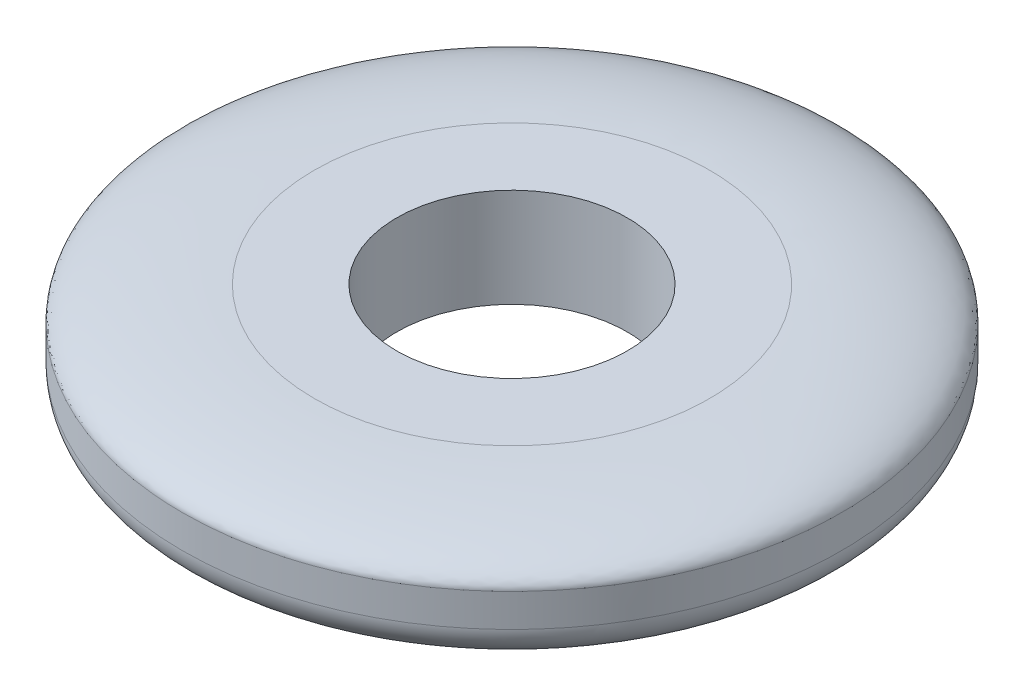
ISO-10303-21;
HEADER;
FILE_DESCRIPTION(('STEP AP214'),'2;1');
FILE_NAME('part.step','',(''),(''),'','','');
FILE_SCHEMA(('AUTOMOTIVE_DESIGN { 1 0 10303 214 1 1 1 1 }'));
ENDSEC;
DATA;
#1=APPLICATION_CONTEXT('core data for automotive mechanical design processes');
#2=APPLICATION_PROTOCOL_DEFINITION('international standard','automotive_design',2000,#1);
#3=PRODUCT_CONTEXT('',#1,'mechanical');
#4=PRODUCT('Part','Part','',(#3));
#5=PRODUCT_RELATED_PRODUCT_CATEGORY('part','',(#4));
#6=PRODUCT_DEFINITION_FORMATION('','',#4);
#7=PRODUCT_DEFINITION_CONTEXT('part definition',#1,'design');
#8=PRODUCT_DEFINITION('design','',#6,#7);
#9=PRODUCT_DEFINITION_SHAPE('','',#8);
#10=(LENGTH_UNIT() NAMED_UNIT(*) SI_UNIT(.MILLI.,.METRE.));
#11=(NAMED_UNIT(*) PLANE_ANGLE_UNIT() SI_UNIT($,.RADIAN.));
#12=(NAMED_UNIT(*) SI_UNIT($,.STERADIAN.) SOLID_ANGLE_UNIT());
#13=UNCERTAINTY_MEASURE_WITH_UNIT(LENGTH_MEASURE(1.E-05),#10,'distance_accuracy_value','');
#14=(GEOMETRIC_REPRESENTATION_CONTEXT(3) GLOBAL_UNCERTAINTY_ASSIGNED_CONTEXT((#13)) GLOBAL_UNIT_ASSIGNED_CONTEXT((#10,
#11,#12)) REPRESENTATION_CONTEXT('',''));
#15=CARTESIAN_POINT('',(0.,0.,0.));
#16=DIRECTION('',(0.,0.,1.));
#17=DIRECTION('',(1.,0.,0.));
#18=AXIS2_PLACEMENT_3D('',#15,#16,#17);
#19=CARTESIAN_POINT('',(0.,3.,0.));
#20=DIRECTION('',(0.,1.,0.));
#21=DIRECTION('',(0.,0.,1.));
#22=AXIS2_PLACEMENT_3D('',#19,#20,#21);
#23=PLANE('',#22);
#24=CARTESIAN_POINT('',(0.,3.,6.));
#25=CARTESIAN_POINT('',(-0.392699079881202,3.,6.));
#26=CARTESIAN_POINT('',(-0.785388454921949,3.,5.96132347236873));
#27=CARTESIAN_POINT('',(-1.55569540927161,3.,5.80809989247003));
#28=CARTESIAN_POINT('',(-1.93329395185282,3.,5.6935566268431));
#29=CARTESIAN_POINT('',(-2.65890723652827,3.,5.39299776329234));
#30=CARTESIAN_POINT('',(-3.00690404641762,3.,5.20698959313112));
#31=CARTESIAN_POINT('',(-3.65993874981762,3.,4.77064575449942));
#32=CARTESIAN_POINT('',(-3.96496050476997,3.,4.5203208694686));
#33=CARTESIAN_POINT('',(-4.52032086946862,3.,3.96496050476995));
#34=CARTESIAN_POINT('',(-4.77064575449942,3.,3.6599387498177));
#35=CARTESIAN_POINT('',(-5.20698959313112,3.,3.00690404641752));
#36=CARTESIAN_POINT('',(-5.39299776329234,3.,2.65890723652834));
#37=CARTESIAN_POINT('',(-5.69355662684311,3.,1.93329395185272));
#38=CARTESIAN_POINT('',(-5.80809989247021,3.,1.55569540927164));
#39=CARTESIAN_POINT('',(-5.96132347236856,3.,0.785388454921894));
#40=CARTESIAN_POINT('',(-6.,3.,0.392699079880683));
#41=CARTESIAN_POINT('',(-6.,3.,-0.392699079880664));
#42=CARTESIAN_POINT('',(-5.96132347236873,3.,-0.785388454921949));
#43=CARTESIAN_POINT('',(-5.80809989247003,3.,-1.55569540927161));
#44=CARTESIAN_POINT('',(-5.6935566268431,3.,-1.93329395185274));
#45=CARTESIAN_POINT('',(-5.39299776329234,3.,-2.65890723652835));
#46=CARTESIAN_POINT('',(-5.20698959313112,3.,-3.00690404641779));
#47=CARTESIAN_POINT('',(-4.77064575449942,3.,-3.65993874981745));
#48=CARTESIAN_POINT('',(-4.52032086946862,3.,-3.96496050476979));
#49=CARTESIAN_POINT('',(-3.96496050476996,3.,-4.52032086946878));
#50=CARTESIAN_POINT('',(-3.65993874981761,3.,-4.77064575449925));
#51=CARTESIAN_POINT('',(-3.00690404641761,3.,-5.2069895931313));
#52=CARTESIAN_POINT('',(-2.65890723652825,3.,-5.39299776329234));
#53=CARTESIAN_POINT('',(-1.93329395185281,3.,-5.69355662684311));
#54=CARTESIAN_POINT('',(-1.55569540927159,3.,-5.80809989247004));
#55=CARTESIAN_POINT('',(-0.785388454921937,3.,-5.96132347236873));
#56=CARTESIAN_POINT('',(-0.392699079880673,3.,-6.));
#57=CARTESIAN_POINT('',(0.392699079880674,3.,-6.));
#58=CARTESIAN_POINT('',(0.785388454921903,3.,-5.96132347236873));
#59=CARTESIAN_POINT('',(1.55569540927164,3.,-5.80809989247004));
#60=CARTESIAN_POINT('',(1.93329395185274,3.,-5.6935566268431));
#61=CARTESIAN_POINT('',(2.65890723652835,3.,-5.39299776329233));
#62=CARTESIAN_POINT('',(3.00690404641761,3.,-5.20698959313112));
#63=CARTESIAN_POINT('',(3.65993874981762,3.,-4.77064575449942));
#64=CARTESIAN_POINT('',(3.96496050476996,3.,-4.52032086946862));
#65=CARTESIAN_POINT('',(4.52032086946861,3.,-3.96496050476996));
#66=CARTESIAN_POINT('',(4.77064575449925,3.,-3.65993874981753));
#67=CARTESIAN_POINT('',(5.2069895931313,3.,-3.00690404641769));
#68=CARTESIAN_POINT('',(5.39299776329231,3.,-2.65890723652832));
#69=CARTESIAN_POINT('',(5.69355662684313,3.,-1.93329395185276));
#70=CARTESIAN_POINT('',(5.8080998924701,3.,-1.55569540927164));
#71=CARTESIAN_POINT('',(5.96132347236866,3.,-0.785388454921893));
#72=CARTESIAN_POINT('',(6.,3.,-0.392699079880672));
#73=CARTESIAN_POINT('',(6.,3.,0.392699079880673));
#74=CARTESIAN_POINT('',(5.96132347236866,3.,0.785388454921901));
#75=CARTESIAN_POINT('',(5.8080998924701,3.,1.55569540927165));
#76=CARTESIAN_POINT('',(5.69355662684313,3.,1.93329395185284));
#77=CARTESIAN_POINT('',(5.39299776329231,3.,2.65890723652823));
#78=CARTESIAN_POINT('',(5.20698959313124,3.,3.0069040464176));
#79=CARTESIAN_POINT('',(4.7706457544993,3.,3.65993874981762));
#80=CARTESIAN_POINT('',(4.52032086946864,3.,3.9649605047701));
#81=CARTESIAN_POINT('',(3.96496050476993,3.,4.52032086946847));
#82=CARTESIAN_POINT('',(3.65993874981754,3.,4.7706457544993));
#83=CARTESIAN_POINT('',(3.00690404641769,3.,5.20698959313124));
#84=CARTESIAN_POINT('',(2.65890723652832,3.,5.39299776329248));
#85=CARTESIAN_POINT('',(1.93329395185276,3.,5.69355662684296));
#86=CARTESIAN_POINT('',(1.55569540927162,3.,5.80809989246978));
#87=CARTESIAN_POINT('',(0.785388454921918,3.,5.96132347236899));
#88=CARTESIAN_POINT('',(0.392699079881201,3.,6.));
#89=CARTESIAN_POINT('',(0.,3.,6.));
#90=(BOUNDED_CURVE() B_SPLINE_CURVE(3,(#24,#25,#26,#27,#28,#29,#30,#31,#32,#33,#34,#35,#36,#37,
#38,#39,#40,#41,#42,#43,#44,#45,#46,#47,#48,#49,#50,#51,#52,#53,#54,#55,#56,#57,#58,#59,#60,#61,
#62,#63,#64,#65,#66,#67,#68,#69,#70,#71,#72,#73,#74,#75,#76,#77,#78,#79,#80,#81,#82,#83,#84,#85,
#86,#87,#88,#89),.UNSPECIFIED.,.T.,.F.) B_SPLINE_CURVE_WITH_KNOTS((4,2,2,2,2,2,2,2,2,2,2,2,2,2,
2,2,2,2,2,2,2,2,2,2,2,2,2,2,2,2,2,2,4),(0.,0.196349540849362,0.392699081698725,
0.589048622548086,0.785398163397448,0.981747704246811,1.17809724509617,1.37444678594553,
1.5707963267949,1.76714586764426,1.96349540849362,2.15984494934298,2.35619449019234,
2.55254403104171,2.74889357189107,2.94524311274043,3.14159265358979,3.33794219443916,
3.53429173528852,3.73064127613788,3.92699081698724,4.1233403578366,4.31968989868597,
4.51603943953533,4.71238898038469,4.90873852123405,5.10508806208341,5.30143760293278,
5.49778714378214,5.6941366846315,5.89048622548086,6.08683576633022,6.28318530717959),
.UNSPECIFIED.) CURVE() GEOMETRIC_REPRESENTATION_ITEM() RATIONAL_B_SPLINE_CURVE((1.,1.,1.,1.,1.,
1.,1.,1.,1.,1.,1.,1.,1.,1.,1.,1.,1.,1.,1.,1.,1.,1.,1.,1.,1.,1.,1.,1.,1.,1.,1.,1.,1.,1.,1.,1.,1.,
1.,1.,1.,1.,1.,1.,1.,1.,1.,1.,1.,1.,1.,1.,1.,1.,1.,1.,1.,1.,1.,1.,1.,1.,1.,1.,1.,1.,1.)) REPRESENTATION_ITEM(''));
#91=CARTESIAN_POINT('',(0.,3.,6.));
#92=VERTEX_POINT('',#91);
#93=EDGE_CURVE('E54',#92,#92,#90,.F.);
#94=ORIENTED_EDGE('',*,*,#93,.T.);
#95=EDGE_LOOP('',(#94));
#96=FACE_BOUND('',#95,.T.);
#97=CARTESIAN_POINT('',(0.,3.,0.));
#98=DIRECTION('',(0.,1.,0.));
#99=DIRECTION('',(0.,0.,1.));
#100=AXIS2_PLACEMENT_3D('',#97,#98,#99);
#101=CIRCLE('',#100,3.5);
#102=CARTESIAN_POINT('',(0.,3.,3.5));
#103=VERTEX_POINT('',#102);
#104=EDGE_CURVE('E148',#103,#103,#101,.T.);
#105=ORIENTED_EDGE('',*,*,#104,.F.);
#106=EDGE_LOOP('',(#105));
#107=FACE_BOUND('',#106,.T.);
#108=ADVANCED_FACE('F40',(#96,#107),#23,.T.);
#109=CARTESIAN_POINT('',(0.,0.,0.));
#110=DIRECTION('',(0.,1.,0.));
#111=DIRECTION('',(0.,0.,1.));
#112=AXIS2_PLACEMENT_3D('',#109,#110,#111);
#113=PLANE('',#112);
#114=CARTESIAN_POINT('',(0.,0.,0.));
#115=DIRECTION('',(0.,1.,0.));
#116=DIRECTION('',(0.,0.,1.));
#117=AXIS2_PLACEMENT_3D('',#114,#115,#116);
#118=CIRCLE('',#117,9.);
#119=CARTESIAN_POINT('',(0.,0.,9.));
#120=VERTEX_POINT('',#119);
#121=EDGE_CURVE('E11',#120,#120,#118,.F.);
#122=ORIENTED_EDGE('',*,*,#121,.T.);
#123=EDGE_LOOP('',(#122));
#124=FACE_BOUND('',#123,.T.);
#125=CARTESIAN_POINT('',(0.,0.,0.));
#126=DIRECTION('',(0.,1.,0.));
#127=DIRECTION('',(0.,0.,1.));
#128=AXIS2_PLACEMENT_3D('',#125,#126,#127);
#129=CIRCLE('',#128,3.5);
#130=CARTESIAN_POINT('',(0.,0.,3.5));
#131=VERTEX_POINT('',#130);
#132=EDGE_CURVE('E146',#131,#131,#129,.T.);
#133=ORIENTED_EDGE('',*,*,#132,.T.);
#134=EDGE_LOOP('',(#133));
#135=FACE_BOUND('',#134,.T.);
#136=ADVANCED_FACE('F137',(#124,#135),#113,.F.);
#137=CARTESIAN_POINT('',(0.,3.,0.));
#138=DIRECTION('',(0.,-1.,0.));
#139=DIRECTION('',(0.,0.,-1.));
#140=AXIS2_PLACEMENT_3D('',#137,#138,#139);
#141=CYLINDRICAL_SURFACE('',#140,10.);
#142=CARTESIAN_POINT('',(0.,1.,0.));
#143=DIRECTION('',(0.,1.,0.));
#144=DIRECTION('',(0.,0.,1.));
#145=AXIS2_PLACEMENT_3D('',#142,#143,#144);
#146=CIRCLE('',#145,10.);
#147=CARTESIAN_POINT('',(0.,1.,10.));
#148=VERTEX_POINT('',#147);
#149=EDGE_CURVE('E46',#148,#148,#146,.T.);
#150=ORIENTED_EDGE('',*,*,#149,.T.);
#151=EDGE_LOOP('',(#150));
#152=FACE_BOUND('',#151,.T.);
#153=CARTESIAN_POINT('',(0.,2.,10.));
#154=CARTESIAN_POINT('',(0.654498466468669,2.,10.));
#155=CARTESIAN_POINT('',(1.30898075820319,2.,9.93553912061457));
#156=CARTESIAN_POINT('',(2.59282568211937,2.,9.68016648745004));
#157=CARTESIAN_POINT('',(3.22215658642126,2.,9.48926104473846));
#158=CARTESIAN_POINT('',(4.43151206088053,2.,8.98832960548728));
#159=CARTESIAN_POINT('',(5.01150674402935,2.,8.67831598855199));
#160=CARTESIAN_POINT('',(6.0998979163627,2.,7.95107625749891));
#161=CARTESIAN_POINT('',(6.60826750794994,2.,7.53386811578101));
#162=CARTESIAN_POINT('',(7.53386811578101,2.,6.60826750794994));
#163=CARTESIAN_POINT('',(7.95107625749883,2.,6.09989791636281));
#164=CARTESIAN_POINT('',(8.67831598855208,2.,5.01150674402923));
#165=CARTESIAN_POINT('',(8.98832960548729,2.,4.4315120608805));
#166=CARTESIAN_POINT('',(9.48926104473845,2.,3.22215658642128));
#167=CARTESIAN_POINT('',(9.68016648745003,2.,2.59282568211947));
#168=CARTESIAN_POINT('',(9.93553912061459,2.,1.30898075820311));
#169=CARTESIAN_POINT('',(10.,2.,0.654498466467789));
#170=CARTESIAN_POINT('',(10.,2.,-0.654498466467787));
#171=CARTESIAN_POINT('',(9.93553912061457,2.,-1.30898075820316));
#172=CARTESIAN_POINT('',(9.68016648745004,2.,-2.59282568211939));
#173=CARTESIAN_POINT('',(9.48926104473848,2.,-3.22215658642122));
#174=CARTESIAN_POINT('',(8.98832960548726,2.,-4.43151206088058));
#175=CARTESIAN_POINT('',(8.67831598855193,2.,-5.01150674402944));
#176=CARTESIAN_POINT('',(7.95107625749898,2.,-6.09989791636259));
#177=CARTESIAN_POINT('',(7.53386811578099,2.,-6.60826750794996));
#178=CARTESIAN_POINT('',(6.60826750794995,2.,-7.533868115781));
#179=CARTESIAN_POINT('',(6.09989791636265,2.,-7.95107625749894));
#180=CARTESIAN_POINT('',(5.01150674402941,2.,-8.67831598855195));
#181=CARTESIAN_POINT('',(4.43151206088059,2.,-8.98832960548725));
#182=CARTESIAN_POINT('',(3.22215658642123,2.,-9.48926104473847));
#183=CARTESIAN_POINT('',(2.59282568211943,2.,-9.68016648745003));
#184=CARTESIAN_POINT('',(1.30898075820315,2.,-9.93553912061458));
#185=CARTESIAN_POINT('',(0.65449846646779,2.,-10.));
#186=CARTESIAN_POINT('',(-0.654498466467788,2.,-10.));
#187=CARTESIAN_POINT('',(-1.30898075820321,2.,-9.93553912061456));
#188=CARTESIAN_POINT('',(-2.59282568211934,2.,-9.68016648745005));
#189=CARTESIAN_POINT('',(-3.22215658642135,2.,-9.48926104473842));
#190=CARTESIAN_POINT('',(-4.43151206088042,2.,-8.98832960548733));
#191=CARTESIAN_POINT('',(-5.01150674402932,2.,-8.67831598855201));
#192=CARTESIAN_POINT('',(-6.09989791636271,2.,-7.9510762574989));
#193=CARTESIAN_POINT('',(-6.60826750794988,2.,-7.53386811578107));
#194=CARTESIAN_POINT('',(-7.53386811578108,2.,-6.60826750794987));
#195=CARTESIAN_POINT('',(-7.95107625749913,2.,-6.09989791636237));
#196=CARTESIAN_POINT('',(-8.67831598855177,2.,-5.01150674402969));
#197=CARTESIAN_POINT('',(-8.98832960548725,2.,-4.43151206088059));
#198=CARTESIAN_POINT('',(-9.48926104473847,2.,-3.22215658642123));
#199=CARTESIAN_POINT('',(-9.68016648745006,2.,-2.59282568211929));
#200=CARTESIAN_POINT('',(-9.93553912061455,2.,-1.3089807582033));
#201=CARTESIAN_POINT('',(-10.,2.,-0.654498466467773));
#202=CARTESIAN_POINT('',(-10.,2.,0.654498466467805));
#203=CARTESIAN_POINT('',(-9.93553912061458,2.,1.30898075820313));
#204=CARTESIAN_POINT('',(-9.68016648745003,2.,2.59282568211942));
#205=CARTESIAN_POINT('',(-9.48926104473848,2.,3.2221565864212));
#206=CARTESIAN_POINT('',(-8.98832960548727,2.,4.43151206088056));
#207=CARTESIAN_POINT('',(-8.67831598855211,2.,5.01150674402917));
#208=CARTESIAN_POINT('',(-7.95107625749879,2.,6.09989791636287));
#209=CARTESIAN_POINT('',(-7.53386811578101,2.,6.60826750794994));
#210=CARTESIAN_POINT('',(-6.60826750794998,2.,7.53386811578097));
#211=CARTESIAN_POINT('',(-6.09989791636261,2.,7.95107625749897));
#212=CARTESIAN_POINT('',(-5.01150674402946,2.,8.67831598855192));
#213=CARTESIAN_POINT('',(-4.43151206088044,2.,8.98832960548731));
#214=CARTESIAN_POINT('',(-3.22215658642138,2.,9.48926104473841));
#215=CARTESIAN_POINT('',(-2.59282568211933,2.,9.68016648745005));
#216=CARTESIAN_POINT('',(-1.30898075820326,2.,9.93553912061455));
#217=CARTESIAN_POINT('',(-0.65449846646867,2.,10.));
#218=CARTESIAN_POINT('',(0.,2.,10.));
#219=(BOUNDED_CURVE() B_SPLINE_CURVE(3,(#153,#154,#155,#156,#157,#158,#159,#160,#161,#162,#163,
#164,#165,#166,#167,#168,#169,#170,#171,#172,#173,#174,#175,#176,#177,#178,#179,#180,#181,#182,
#183,#184,#185,#186,#187,#188,#189,#190,#191,#192,#193,#194,#195,#196,#197,#198,#199,#200,#201,
#202,#203,#204,#205,#206,#207,#208,#209,#210,#211,#212,#213,#214,#215,#216,#217,#218),
.UNSPECIFIED.,.T.,.F.) B_SPLINE_CURVE_WITH_KNOTS((4,2,2,2,2,2,2,2,2,2,2,2,2,2,2,2,2,2,2,2,2,2,2,
2,2,2,2,2,2,2,2,2,4),(0.,0.196349540849362,0.392699081698724,0.589048622548086,
0.785398163397448,0.98174770424681,1.17809724509617,1.37444678594553,1.5707963267949,
1.76714586764426,1.96349540849362,2.15984494934298,2.35619449019234,2.55254403104171,
2.74889357189107,2.94524311274043,3.14159265358979,3.33794219443916,3.53429173528852,
3.73064127613788,3.92699081698724,4.1233403578366,4.31968989868597,4.51603943953533,
4.71238898038469,4.90873852123405,5.10508806208341,5.30143760293278,5.49778714378214,
5.6941366846315,5.89048622548086,6.08683576633022,6.28318530717959),
.UNSPECIFIED.) CURVE() GEOMETRIC_REPRESENTATION_ITEM() RATIONAL_B_SPLINE_CURVE((1.,1.,1.,1.,1.,
1.,1.,1.,1.,1.,1.,1.,1.,1.,1.,1.,1.,1.,1.,1.,1.,1.,1.,1.,1.,1.,1.,1.,1.,1.,1.,1.,1.,1.,1.,1.,1.,
1.,1.,1.,1.,1.,1.,1.,1.,1.,1.,1.,1.,1.,1.,1.,1.,1.,1.,1.,1.,1.,1.,1.,1.,1.,1.,1.,1.,1.)) REPRESENTATION_ITEM(''));
#220=CARTESIAN_POINT('',(0.,2.,10.));
#221=VERTEX_POINT('',#220);
#222=EDGE_CURVE('E50',#221,#221,#219,.F.);
#223=ORIENTED_EDGE('',*,*,#222,.T.);
#224=EDGE_LOOP('',(#223));
#225=FACE_BOUND('',#224,.T.);
#226=ADVANCED_FACE('F77',(#152,#225),#141,.T.);
#227=CARTESIAN_POINT('',(0.,3.,0.));
#228=DIRECTION('',(0.,-1.,0.));
#229=DIRECTION('',(0.,0.,-1.));
#230=AXIS2_PLACEMENT_3D('',#227,#228,#229);
#231=CYLINDRICAL_SURFACE('',#230,3.5);
#232=ORIENTED_EDGE('',*,*,#104,.T.);
#233=EDGE_LOOP('',(#232));
#234=FACE_BOUND('',#233,.T.);
#235=ORIENTED_EDGE('',*,*,#132,.F.);
#236=EDGE_LOOP('',(#235));
#237=FACE_BOUND('',#236,.T.);
#238=ADVANCED_FACE('F75',(#234,#237),#231,.F.);
#239=CARTESIAN_POINT('',(0.,3.,6.));
#240=CARTESIAN_POINT('',(0.392699079881201,3.,6.));
#241=CARTESIAN_POINT('',(0.785388454921918,3.,5.96132347236899));
#242=CARTESIAN_POINT('',(1.55569540927162,3.,5.80809989246978));
#243=CARTESIAN_POINT('',(1.93329395185276,3.,5.69355662684296));
#244=CARTESIAN_POINT('',(2.65890723652832,3.,5.39299776329248));
#245=CARTESIAN_POINT('',(3.00690404641769,3.,5.20698959313124));
#246=CARTESIAN_POINT('',(3.65993874981754,3.,4.7706457544993));
#247=CARTESIAN_POINT('',(3.96496050476993,3.,4.52032086946847));
#248=CARTESIAN_POINT('',(4.52032086946864,3.,3.9649605047701));
#249=CARTESIAN_POINT('',(4.7706457544993,3.,3.65993874981762));
#250=CARTESIAN_POINT('',(5.20698959313124,3.,3.0069040464176));
#251=CARTESIAN_POINT('',(5.39299776329231,3.,2.65890723652823));
#252=CARTESIAN_POINT('',(5.69355662684313,3.,1.93329395185284));
#253=CARTESIAN_POINT('',(5.8080998924701,3.,1.55569540927165));
#254=CARTESIAN_POINT('',(5.96132347236866,3.,0.785388454921901));
#255=CARTESIAN_POINT('',(6.,3.,0.392699079880673));
#256=CARTESIAN_POINT('',(6.,3.,-0.392699079880672));
#257=CARTESIAN_POINT('',(5.96132347236866,3.,-0.785388454921893));
#258=CARTESIAN_POINT('',(5.8080998924701,3.,-1.55569540927164));
#259=CARTESIAN_POINT('',(5.69355662684313,3.,-1.93329395185276));
#260=CARTESIAN_POINT('',(5.39299776329231,3.,-2.65890723652832));
#261=CARTESIAN_POINT('',(5.2069895931313,3.,-3.00690404641769));
#262=CARTESIAN_POINT('',(4.77064575449925,3.,-3.65993874981753));
#263=CARTESIAN_POINT('',(4.52032086946861,3.,-3.96496050476996));
#264=CARTESIAN_POINT('',(3.96496050476996,3.,-4.52032086946862));
#265=CARTESIAN_POINT('',(3.65993874981762,3.,-4.77064575449942));
#266=CARTESIAN_POINT('',(3.00690404641761,3.,-5.20698959313112));
#267=CARTESIAN_POINT('',(2.65890723652835,3.,-5.39299776329233));
#268=CARTESIAN_POINT('',(1.93329395185274,3.,-5.6935566268431));
#269=CARTESIAN_POINT('',(1.55569540927164,3.,-5.80809989247004));
#270=CARTESIAN_POINT('',(0.785388454921903,3.,-5.96132347236873));
#271=CARTESIAN_POINT('',(0.392699079880674,3.,-6.));
#272=CARTESIAN_POINT('',(-0.392699079880673,3.,-6.));
#273=CARTESIAN_POINT('',(-0.785388454921937,3.,-5.96132347236873));
#274=CARTESIAN_POINT('',(-1.55569540927159,3.,-5.80809989247004));
#275=CARTESIAN_POINT('',(-1.93329395185281,3.,-5.69355662684311));
#276=CARTESIAN_POINT('',(-2.65890723652825,3.,-5.39299776329234));
#277=CARTESIAN_POINT('',(-3.00690404641761,3.,-5.2069895931313));
#278=CARTESIAN_POINT('',(-3.65993874981761,3.,-4.77064575449925));
#279=CARTESIAN_POINT('',(-3.96496050476996,3.,-4.52032086946878));
#280=CARTESIAN_POINT('',(-4.52032086946862,3.,-3.96496050476979));
#281=CARTESIAN_POINT('',(-4.77064575449942,3.,-3.65993874981745));
#282=CARTESIAN_POINT('',(-5.20698959313112,3.,-3.00690404641779));
#283=CARTESIAN_POINT('',(-5.39299776329234,3.,-2.65890723652835));
#284=CARTESIAN_POINT('',(-5.6935566268431,3.,-1.93329395185274));
#285=CARTESIAN_POINT('',(-5.80809989247003,3.,-1.55569540927161));
#286=CARTESIAN_POINT('',(-5.96132347236873,3.,-0.785388454921949));
#287=CARTESIAN_POINT('',(-6.,3.,-0.392699079880664));
#288=CARTESIAN_POINT('',(-6.,3.,0.392699079880683));
#289=CARTESIAN_POINT('',(-5.96132347236856,3.,0.785388454921894));
#290=CARTESIAN_POINT('',(-5.80809989247021,3.,1.55569540927164));
#291=CARTESIAN_POINT('',(-5.69355662684311,3.,1.93329395185272));
#292=CARTESIAN_POINT('',(-5.39299776329234,3.,2.65890723652834));
#293=CARTESIAN_POINT('',(-5.20698959313112,3.,3.00690404641752));
#294=CARTESIAN_POINT('',(-4.77064575449942,3.,3.6599387498177));
#295=CARTESIAN_POINT('',(-4.52032086946862,3.,3.96496050476995));
#296=CARTESIAN_POINT('',(-3.96496050476997,3.,4.5203208694686));
#297=CARTESIAN_POINT('',(-3.65993874981762,3.,4.77064575449942));
#298=CARTESIAN_POINT('',(-3.00690404641762,3.,5.20698959313112));
#299=CARTESIAN_POINT('',(-2.65890723652827,3.,5.39299776329234));
#300=CARTESIAN_POINT('',(-1.93329395185282,3.,5.6935566268431));
#301=CARTESIAN_POINT('',(-1.55569540927161,3.,5.80809989247003));
#302=CARTESIAN_POINT('',(-0.785388454921949,3.,5.96132347236873));
#303=CARTESIAN_POINT('',(-0.392699079881202,3.,6.));
#304=CARTESIAN_POINT('',(0.,3.,6.));
#305=CARTESIAN_POINT('',(0.,3.,10.));
#306=CARTESIAN_POINT('',(0.654498466468669,3.,10.));
#307=CARTESIAN_POINT('',(1.3089807582032,2.99999999999932,9.93553912061459));
#308=CARTESIAN_POINT('',(2.59282568211937,3.00000000000068,9.68016648745002));
#309=CARTESIAN_POINT('',(3.22215658642121,2.99999999999932,9.48926104473833));
#310=CARTESIAN_POINT('',(4.43151206088059,3.00000000000068,8.98832960548741));
#311=CARTESIAN_POINT('',(5.01150674402937,3.,8.67831598855201));
#312=CARTESIAN_POINT('',(6.09989791636268,3.,7.95107625749889));
#313=CARTESIAN_POINT('',(6.60826750795011,3.,7.53386811578118));
#314=CARTESIAN_POINT('',(7.53386811578084,3.,6.60826750794977));
#315=CARTESIAN_POINT('',(7.95107625749889,3.00000000000017,6.09989791636268));
#316=CARTESIAN_POINT('',(8.67831598855202,2.99999999999983,5.01150674402936));
#317=CARTESIAN_POINT('',(8.98832960548707,3.,4.43151206088041));
#318=CARTESIAN_POINT('',(9.48926104473867,3.,3.22215658642137));
#319=CARTESIAN_POINT('',(9.68016648744966,3.,2.5928256821194));
#320=CARTESIAN_POINT('',(9.93553912061495,3.,1.30898075820318));
#321=CARTESIAN_POINT('',(10.,3.,0.654498466467789));
#322=CARTESIAN_POINT('',(10.,3.,-0.654498466467788));
#323=CARTESIAN_POINT('',(9.93553912061461,2.99999999999932,-1.30898075820317));
#324=CARTESIAN_POINT('',(9.68016648745,3.00000000000068,-2.59282568211938));
#325=CARTESIAN_POINT('',(9.48926104473867,3.,-3.22215658642138));
#326=CARTESIAN_POINT('',(8.98832960548707,3.,-4.43151206088042));
#327=CARTESIAN_POINT('',(8.67831598855188,3.,-5.0115067440294));
#328=CARTESIAN_POINT('',(7.95107625749904,3.,-6.09989791636263));
#329=CARTESIAN_POINT('',(7.53386811578107,3.,-6.60826750794988));
#330=CARTESIAN_POINT('',(6.60826750794987,3.,-7.53386811578108));
#331=CARTESIAN_POINT('',(6.09989791636247,3.,-7.95107625749869));
#332=CARTESIAN_POINT('',(5.01150674402959,3.,-8.67831598855221));
#333=CARTESIAN_POINT('',(4.43151206088073,3.00000000000068,-8.98832960548739));
#334=CARTESIAN_POINT('',(3.22215658642109,2.99999999999932,-9.48926104473833));
#335=CARTESIAN_POINT('',(2.59282568211939,3.,-9.68016648744983));
#336=CARTESIAN_POINT('',(1.30898075820319,3.,-9.93553912061478));
#337=CARTESIAN_POINT('',(0.65449846646779,3.,-10.));
#338=CARTESIAN_POINT('',(-0.654498466467788,3.,-10.));
#339=CARTESIAN_POINT('',(-1.30898075820326,3.,-9.93553912061478));
#340=CARTESIAN_POINT('',(-2.59282568211929,3.,-9.68016648744983));
#341=CARTESIAN_POINT('',(-3.22215658642115,2.99999999999932,-9.48926104473834));
#342=CARTESIAN_POINT('',(-4.43151206088062,3.00000000000068,-8.98832960548741));
#343=CARTESIAN_POINT('',(-5.01150674402923,3.,-8.67831598855154));
#344=CARTESIAN_POINT('',(-6.0998979163628,3.,-7.95107625749938));
#345=CARTESIAN_POINT('',(-6.60826750794971,3.,-7.53386811578107));
#346=CARTESIAN_POINT('',(-7.53386811578125,3.,-6.60826750794987));
#347=CARTESIAN_POINT('',(-7.95107625749903,2.99999999999983,-6.09989791636247));
#348=CARTESIAN_POINT('',(-8.67831598855187,3.00000000000017,-5.01150674402959));
#349=CARTESIAN_POINT('',(-8.98832960548739,3.00000000000068,-4.43151206088073));
#350=CARTESIAN_POINT('',(-9.48926104473833,2.99999999999932,-3.22215658642109));
#351=CARTESIAN_POINT('',(-9.68016648745017,3.,-2.59282568211931));
#352=CARTESIAN_POINT('',(-9.93553912061443,3.,-1.30898075820328));
#353=CARTESIAN_POINT('',(-10.,3.,-0.654498466467773));
#354=CARTESIAN_POINT('',(-10.,3.,0.654498466467805));
#355=CARTESIAN_POINT('',(-9.93553912061478,2.99999999999932,1.30898075820313));
#356=CARTESIAN_POINT('',(-9.68016648744983,3.00000000000068,2.59282568211942));
#357=CARTESIAN_POINT('',(-9.48926104473834,2.99999999999932,3.22215658642106));
#358=CARTESIAN_POINT('',(-8.98832960548741,3.00000000000068,4.4315120608807));
#359=CARTESIAN_POINT('',(-8.67831598855221,3.,5.01150674402924));
#360=CARTESIAN_POINT('',(-7.95107625749869,3.,6.0998979163628));
#361=CARTESIAN_POINT('',(-7.5338681157811,3.,6.60826750795002));
#362=CARTESIAN_POINT('',(-6.60826750794989,3.,7.53386811578089));
#363=CARTESIAN_POINT('',(-6.09989791636282,3.,7.95107625749903));
#364=CARTESIAN_POINT('',(-5.01150674402925,3.,8.67831598855187));
#365=CARTESIAN_POINT('',(-4.43151206088048,3.00000000000068,8.98832960548739));
#366=CARTESIAN_POINT('',(-3.22215658642135,2.99999999999932,9.48926104473833));
#367=CARTESIAN_POINT('',(-2.59282568211936,3.,9.68016648745017));
#368=CARTESIAN_POINT('',(-1.30898075820323,3.,9.93553912061443));
#369=CARTESIAN_POINT('',(-0.65449846646867,3.,10.));
#370=CARTESIAN_POINT('',(0.,3.,10.));
#371=CARTESIAN_POINT('',(0.,2.,10.));
#372=CARTESIAN_POINT('',(0.654498466468669,2.,10.));
#373=CARTESIAN_POINT('',(1.30898075820319,2.,9.93553912061457));
#374=CARTESIAN_POINT('',(2.59282568211937,2.,9.68016648745004));
#375=CARTESIAN_POINT('',(3.22215658642126,2.,9.48926104473846));
#376=CARTESIAN_POINT('',(4.43151206088053,2.,8.98832960548728));
#377=CARTESIAN_POINT('',(5.01150674402935,2.,8.67831598855199));
#378=CARTESIAN_POINT('',(6.0998979163627,2.,7.95107625749891));
#379=CARTESIAN_POINT('',(6.60826750794994,2.,7.53386811578101));
#380=CARTESIAN_POINT('',(7.53386811578101,2.,6.60826750794994));
#381=CARTESIAN_POINT('',(7.95107625749883,2.,6.09989791636281));
#382=CARTESIAN_POINT('',(8.67831598855208,2.,5.01150674402923));
#383=CARTESIAN_POINT('',(8.98832960548729,2.,4.4315120608805));
#384=CARTESIAN_POINT('',(9.48926104473845,2.,3.22215658642128));
#385=CARTESIAN_POINT('',(9.68016648745003,2.,2.59282568211947));
#386=CARTESIAN_POINT('',(9.93553912061459,2.,1.30898075820311));
#387=CARTESIAN_POINT('',(10.,2.,0.654498466467789));
#388=CARTESIAN_POINT('',(10.,2.,-0.654498466467787));
#389=CARTESIAN_POINT('',(9.93553912061457,2.,-1.30898075820316));
#390=CARTESIAN_POINT('',(9.68016648745004,2.,-2.59282568211939));
#391=CARTESIAN_POINT('',(9.48926104473848,2.,-3.22215658642122));
#392=CARTESIAN_POINT('',(8.98832960548726,2.,-4.43151206088058));
#393=CARTESIAN_POINT('',(8.67831598855193,2.,-5.01150674402944));
#394=CARTESIAN_POINT('',(7.95107625749898,2.,-6.09989791636259));
#395=CARTESIAN_POINT('',(7.53386811578099,2.,-6.60826750794996));
#396=CARTESIAN_POINT('',(6.60826750794995,2.,-7.533868115781));
#397=CARTESIAN_POINT('',(6.09989791636265,2.,-7.95107625749894));
#398=CARTESIAN_POINT('',(5.01150674402941,2.,-8.67831598855195));
#399=CARTESIAN_POINT('',(4.43151206088059,2.,-8.98832960548725));
#400=CARTESIAN_POINT('',(3.22215658642123,2.,-9.48926104473847));
#401=CARTESIAN_POINT('',(2.59282568211943,2.,-9.68016648745003));
#402=CARTESIAN_POINT('',(1.30898075820315,2.,-9.93553912061458));
#403=CARTESIAN_POINT('',(0.65449846646779,2.,-10.));
#404=CARTESIAN_POINT('',(-0.654498466467788,2.,-10.));
#405=CARTESIAN_POINT('',(-1.30898075820321,2.,-9.93553912061456));
#406=CARTESIAN_POINT('',(-2.59282568211934,2.,-9.68016648745005));
#407=CARTESIAN_POINT('',(-3.22215658642135,2.,-9.48926104473842));
#408=CARTESIAN_POINT('',(-4.43151206088042,2.,-8.98832960548733));
#409=CARTESIAN_POINT('',(-5.01150674402932,2.,-8.67831598855201));
#410=CARTESIAN_POINT('',(-6.09989791636271,2.,-7.9510762574989));
#411=CARTESIAN_POINT('',(-6.60826750794988,2.,-7.53386811578107));
#412=CARTESIAN_POINT('',(-7.53386811578108,2.,-6.60826750794987));
#413=CARTESIAN_POINT('',(-7.95107625749913,2.,-6.09989791636237));
#414=CARTESIAN_POINT('',(-8.67831598855177,2.,-5.01150674402969));
#415=CARTESIAN_POINT('',(-8.98832960548725,2.,-4.43151206088059));
#416=CARTESIAN_POINT('',(-9.48926104473847,2.,-3.22215658642123));
#417=CARTESIAN_POINT('',(-9.68016648745006,2.,-2.59282568211929));
#418=CARTESIAN_POINT('',(-9.93553912061455,2.,-1.3089807582033));
#419=CARTESIAN_POINT('',(-10.,2.,-0.654498466467773));
#420=CARTESIAN_POINT('',(-10.,2.,0.654498466467805));
#421=CARTESIAN_POINT('',(-9.93553912061458,2.,1.30898075820313));
#422=CARTESIAN_POINT('',(-9.68016648745003,2.,2.59282568211942));
#423=CARTESIAN_POINT('',(-9.48926104473848,2.,3.2221565864212));
#424=CARTESIAN_POINT('',(-8.98832960548727,2.,4.43151206088056));
#425=CARTESIAN_POINT('',(-8.67831598855211,2.,5.01150674402917));
#426=CARTESIAN_POINT('',(-7.95107625749879,2.,6.09989791636287));
#427=CARTESIAN_POINT('',(-7.53386811578101,2.,6.60826750794994));
#428=CARTESIAN_POINT('',(-6.60826750794998,2.,7.53386811578097));
#429=CARTESIAN_POINT('',(-6.09989791636261,2.,7.95107625749897));
#430=CARTESIAN_POINT('',(-5.01150674402946,2.,8.67831598855192));
#431=CARTESIAN_POINT('',(-4.43151206088044,2.,8.98832960548731));
#432=CARTESIAN_POINT('',(-3.22215658642138,2.,9.48926104473841));
#433=CARTESIAN_POINT('',(-2.59282568211933,2.,9.68016648745005));
#434=CARTESIAN_POINT('',(-1.30898075820326,2.,9.93553912061455));
#435=CARTESIAN_POINT('',(-0.65449846646867,2.,10.));
#436=CARTESIAN_POINT('',(0.,2.,10.));
#437=(BOUNDED_SURFACE() B_SPLINE_SURFACE(2,3,((#239,#240,#241,#242,#243,#244,#245,#246,#247,
#248,#249,#250,#251,#252,#253,#254,#255,#256,#257,#258,#259,#260,#261,#262,#263,#264,#265,#266,
#267,#268,#269,#270,#271,#272,#273,#274,#275,#276,#277,#278,#279,#280,#281,#282,#283,#284,#285,
#286,#287,#288,#289,#290,#291,#292,#293,#294,#295,#296,#297,#298,#299,#300,#301,#302,#303,#304),
(#305,#306,#307,#308,#309,#310,#311,#312,#313,#314,#315,#316,#317,#318,#319,#320,#321,#322,#323,
#324,#325,#326,#327,#328,#329,#330,#331,#332,#333,#334,#335,#336,#337,#338,#339,#340,#341,#342,
#343,#344,#345,#346,#347,#348,#349,#350,#351,#352,#353,#354,#355,#356,#357,#358,#359,#360,#361,
#362,#363,#364,#365,#366,#367,#368,#369,#370),(#371,#372,#373,#374,#375,#376,#377,#378,#379,
#380,#381,#382,#383,#384,#385,#386,#387,#388,#389,#390,#391,#392,#393,#394,#395,#396,#397,#398,
#399,#400,#401,#402,#403,#404,#405,#406,#407,#408,#409,#410,#411,#412,#413,#414,#415,#416,#417,
#418,#419,#420,#421,#422,#423,#424,#425,#426,#427,#428,#429,#430,#431,#432,#433,#434,#435,
#436)),.UNSPECIFIED.,.F.,.T.,.F.) B_SPLINE_SURFACE_WITH_KNOTS((3,3),(4,2,2,2,2,2,2,2,2,2,2,2,2,
2,2,2,2,2,2,2,2,2,2,2,2,2,2,2,2,2,2,2,4),(0.,1.),(0.,0.196349540849362,0.392699081698724,
0.589048622548086,0.785398163397448,0.98174770424681,1.17809724509617,1.37444678594553,
1.5707963267949,1.76714586764426,1.96349540849362,2.15984494934298,2.35619449019234,
2.55254403104171,2.74889357189107,2.94524311274043,3.14159265358979,3.33794219443916,
3.53429173528852,3.73064127613788,3.92699081698724,4.1233403578366,4.31968989868597,
4.51603943953533,4.71238898038469,4.90873852123405,5.10508806208341,5.30143760293278,
5.49778714378214,5.6941366846315,5.89048622548086,6.08683576633022,6.28318530717959),
.UNSPECIFIED.) GEOMETRIC_REPRESENTATION_ITEM() RATIONAL_B_SPLINE_SURFACE(((1.,1.,1.,1.,1.,1.,1.,
1.,1.,1.,1.,1.,1.,1.,1.,1.,1.,1.,1.,1.,1.,1.,1.,1.,1.,1.,1.,1.,1.,1.,1.,1.,1.,1.,1.,1.,1.,1.,1.,
1.,1.,1.,1.,1.,1.,1.,1.,1.,1.,1.,1.,1.,1.,1.,1.,1.,1.,1.,1.,1.,1.,1.,1.,1.,1.,1.),
(0.707106781186547,0.707106781186547,0.707106781186548,0.707106781186548,0.707106781186548,
0.707106781186548,0.707106781186548,0.707106781186548,0.707106781186548,0.707106781186548,
0.707106781186547,0.707106781186547,0.707106781186548,0.707106781186548,0.707106781186548,
0.707106781186548,0.707106781186547,0.707106781186547,0.707106781186548,0.707106781186548,
0.707106781186547,0.707106781186547,0.707106781186548,0.707106781186548,0.707106781186548,
0.707106781186548,0.707106781186548,0.707106781186548,0.707106781186548,0.707106781186548,
0.707106781186548,0.707106781186548,0.707106781186547,0.707106781186547,0.707106781186548,
0.707106781186548,0.707106781186548,0.707106781186548,0.707106781186548,0.707106781186548,
0.707106781186548,0.707106781186548,0.707106781186548,0.707106781186548,0.707106781186548,
0.707106781186548,0.707106781186548,0.707106781186548,0.707106781186547,0.707106781186547,
0.707106781186548,0.707106781186548,0.707106781186548,0.707106781186548,0.707106781186548,
0.707106781186548,0.707106781186548,0.707106781186548,0.707106781186548,0.707106781186548,
0.707106781186548,0.707106781186548,0.707106781186548,0.707106781186548,0.707106781186547,
0.707106781186547),(1.,1.,1.,1.,1.,1.,1.,1.,1.,1.,1.,1.,1.,1.,1.,1.,1.,1.,1.,1.,1.,1.,1.,1.,1.,
1.,1.,1.,1.,1.,1.,1.,1.,1.,1.,1.,1.,1.,1.,1.,1.,1.,1.,1.,1.,1.,1.,1.,1.,1.,1.,1.,1.,1.,1.,1.,1.,
1.,1.,1.,1.,1.,1.,1.,1.,1.))) REPRESENTATION_ITEM('') SURFACE());
#438=ORIENTED_EDGE('',*,*,#222,.F.);
#439=EDGE_LOOP('',(#438));
#440=FACE_BOUND('',#439,.T.);
#441=ORIENTED_EDGE('',*,*,#93,.F.);
#442=EDGE_LOOP('',(#441));
#443=FACE_BOUND('',#442,.T.);
#444=ADVANCED_FACE('F62',(#440,#443),#437,.T.);
#445=CARTESIAN_POINT('',(0.,1.,0.));
#446=DIRECTION('',(0.,1.,0.));
#447=DIRECTION('',(0.,0.,1.));
#448=AXIS2_PLACEMENT_3D('',#445,#446,#447);
#449=TOROIDAL_SURFACE('',#448,9.,1.);
#450=ORIENTED_EDGE('',*,*,#121,.F.);
#451=EDGE_LOOP('',(#450));
#452=FACE_BOUND('',#451,.T.);
#453=ORIENTED_EDGE('',*,*,#149,.F.);
#454=EDGE_LOOP('',(#453));
#455=FACE_BOUND('',#454,.T.);
#456=ADVANCED_FACE('F42',(#452,#455),#449,.T.);
#457=CLOSED_SHELL('',(#108,#136,#226,#238,#444,#456));
#458=MANIFOLD_SOLID_BREP('B2',#457);
#459=ADVANCED_BREP_SHAPE_REPRESENTATION('',(#18,#458),#14);
#460=SHAPE_DEFINITION_REPRESENTATION(#9,#459);
ENDSEC;
END-ISO-10303-21;
